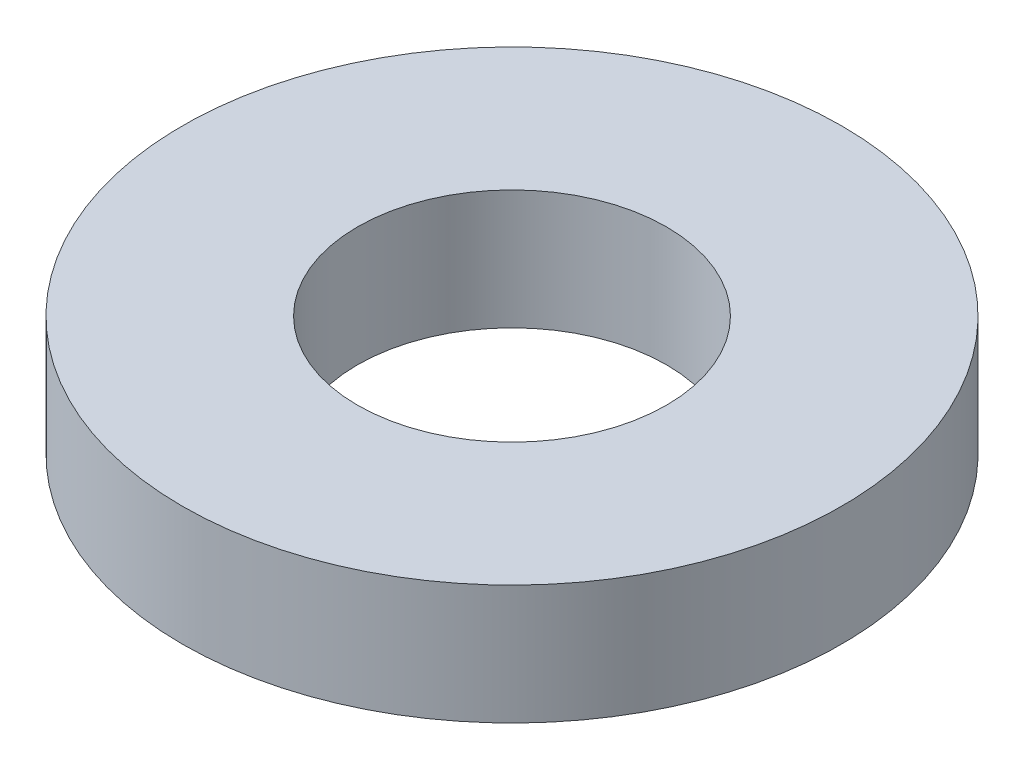
ISO-10303-21;
HEADER;
FILE_DESCRIPTION(('STEP AP214'),'2;1');
FILE_NAME('part.step','',(''),(''),'','','');
FILE_SCHEMA(('AUTOMOTIVE_DESIGN { 1 0 10303 214 1 1 1 1 }'));
ENDSEC;
DATA;
#1=APPLICATION_CONTEXT('core data for automotive mechanical design processes');
#2=APPLICATION_PROTOCOL_DEFINITION('international standard','automotive_design',2000,#1);
#3=PRODUCT_CONTEXT('',#1,'mechanical');
#4=PRODUCT('Part','Part','',(#3));
#5=PRODUCT_RELATED_PRODUCT_CATEGORY('part','',(#4));
#6=PRODUCT_DEFINITION_FORMATION('','',#4);
#7=PRODUCT_DEFINITION_CONTEXT('part definition',#1,'design');
#8=PRODUCT_DEFINITION('design','',#6,#7);
#9=PRODUCT_DEFINITION_SHAPE('','',#8);
#10=(LENGTH_UNIT() NAMED_UNIT(*) SI_UNIT(.MILLI.,.METRE.));
#11=(NAMED_UNIT(*) PLANE_ANGLE_UNIT() SI_UNIT($,.RADIAN.));
#12=(NAMED_UNIT(*) SI_UNIT($,.STERADIAN.) SOLID_ANGLE_UNIT());
#13=UNCERTAINTY_MEASURE_WITH_UNIT(LENGTH_MEASURE(1.E-05),#10,'distance_accuracy_value','');
#14=(GEOMETRIC_REPRESENTATION_CONTEXT(3) GLOBAL_UNCERTAINTY_ASSIGNED_CONTEXT((#13)) GLOBAL_UNIT_ASSIGNED_CONTEXT((#10,
#11,#12)) REPRESENTATION_CONTEXT('',''));
#15=CARTESIAN_POINT('',(0.,0.,0.));
#16=DIRECTION('',(0.,0.,1.));
#17=DIRECTION('',(1.,0.,0.));
#18=AXIS2_PLACEMENT_3D('',#15,#16,#17);
#19=CARTESIAN_POINT('',(0.,29.,0.));
#20=DIRECTION('',(0.,-1.,0.));
#21=DIRECTION('',(0.,0.,-1.));
#22=AXIS2_PLACEMENT_3D('',#19,#20,#21);
#23=CYLINDRICAL_SURFACE('',#22,80.);
#24=CARTESIAN_POINT('',(0.,29.,0.));
#25=DIRECTION('',(0.,1.,0.));
#26=DIRECTION('',(0.,0.,1.));
#27=AXIS2_PLACEMENT_3D('',#24,#25,#26);
#28=CIRCLE('',#27,80.);
#29=CARTESIAN_POINT('',(0.,29.,-80.));
#30=VERTEX_POINT('',#29);
#31=EDGE_CURVE('E10',#30,#30,#28,.T.);
#32=CARTESIAN_POINT('',(0.,0.,0.));
#33=DIRECTION('',(0.,1.,0.));
#34=DIRECTION('',(0.,0.,1.));
#35=AXIS2_PLACEMENT_3D('',#32,#33,#34);
#36=CIRCLE('',#35,80.);
#37=CARTESIAN_POINT('',(0.,0.,-80.));
#38=VERTEX_POINT('',#37);
#39=EDGE_CURVE('E37',#38,#38,#36,.T.);
#40=CARTESIAN_POINT('',(0.,29.,-80.));
#41=CARTESIAN_POINT('',(0.,28.6979166666667,-80.));
#42=CARTESIAN_POINT('',(0.,28.3958333333333,-80.));
#43=CARTESIAN_POINT('',(0.,27.7916666666667,-80.));
#44=CARTESIAN_POINT('',(0.,27.4895833333333,-80.));
#45=CARTESIAN_POINT('',(0.,26.8854166666667,-80.));
#46=CARTESIAN_POINT('',(0.,26.5833333333333,-80.));
#47=CARTESIAN_POINT('',(0.,25.9791666666667,-80.));
#48=CARTESIAN_POINT('',(0.,25.6770833333333,-80.));
#49=CARTESIAN_POINT('',(0.,25.0729166666667,-80.));
#50=CARTESIAN_POINT('',(0.,24.7708333333333,-80.));
#51=CARTESIAN_POINT('',(0.,24.1666666666667,-80.));
#52=CARTESIAN_POINT('',(0.,23.8645833333333,-80.));
#53=CARTESIAN_POINT('',(0.,23.2604166666667,-80.));
#54=CARTESIAN_POINT('',(0.,22.9583333333333,-80.));
#55=CARTESIAN_POINT('',(0.,22.3541666666667,-80.));
#56=CARTESIAN_POINT('',(0.,22.0520833333333,-80.));
#57=CARTESIAN_POINT('',(0.,21.4479166666667,-80.));
#58=CARTESIAN_POINT('',(0.,21.1458333333333,-80.));
#59=CARTESIAN_POINT('',(0.,20.5416666666667,-80.));
#60=CARTESIAN_POINT('',(0.,20.2395833333333,-80.));
#61=CARTESIAN_POINT('',(0.,19.6354166666667,-80.));
#62=CARTESIAN_POINT('',(0.,19.3333333333333,-80.));
#63=CARTESIAN_POINT('',(0.,18.7291666666667,-80.));
#64=CARTESIAN_POINT('',(0.,18.4270833333333,-80.));
#65=CARTESIAN_POINT('',(0.,17.8229166666667,-80.));
#66=CARTESIAN_POINT('',(0.,17.5208333333333,-80.));
#67=CARTESIAN_POINT('',(0.,16.9166666666667,-80.));
#68=CARTESIAN_POINT('',(0.,16.6145833333333,-80.));
#69=CARTESIAN_POINT('',(0.,16.0104166666667,-80.));
#70=CARTESIAN_POINT('',(0.,15.7083333333333,-80.));
#71=CARTESIAN_POINT('',(0.,15.1041666666667,-80.));
#72=CARTESIAN_POINT('',(0.,14.8020833333333,-80.));
#73=CARTESIAN_POINT('',(0.,14.1979166666667,-80.));
#74=CARTESIAN_POINT('',(0.,13.8958333333333,-80.));
#75=CARTESIAN_POINT('',(0.,13.2916666666667,-80.));
#76=CARTESIAN_POINT('',(0.,12.9895833333333,-80.));
#77=CARTESIAN_POINT('',(0.,12.3854166666667,-80.));
#78=CARTESIAN_POINT('',(0.,12.0833333333333,-80.));
#79=CARTESIAN_POINT('',(0.,11.4791666666667,-80.));
#80=CARTESIAN_POINT('',(0.,11.1770833333333,-80.));
#81=CARTESIAN_POINT('',(0.,10.5729166666667,-80.));
#82=CARTESIAN_POINT('',(0.,10.2708333333333,-80.));
#83=CARTESIAN_POINT('',(0.,9.66666666666667,-80.));
#84=CARTESIAN_POINT('',(0.,9.36458333333333,-80.));
#85=CARTESIAN_POINT('',(0.,8.76041666666667,-80.));
#86=CARTESIAN_POINT('',(0.,8.45833333333333,-80.));
#87=CARTESIAN_POINT('',(0.,7.85416666666667,-80.));
#88=CARTESIAN_POINT('',(0.,7.55208333333333,-80.));
#89=CARTESIAN_POINT('',(0.,6.94791666666667,-80.));
#90=CARTESIAN_POINT('',(0.,6.64583333333333,-80.));
#91=CARTESIAN_POINT('',(0.,6.04166666666667,-80.));
#92=CARTESIAN_POINT('',(0.,5.73958333333333,-80.));
#93=CARTESIAN_POINT('',(0.,5.13541666666667,-80.));
#94=CARTESIAN_POINT('',(0.,4.83333333333333,-80.));
#95=CARTESIAN_POINT('',(0.,4.22916666666667,-80.));
#96=CARTESIAN_POINT('',(0.,3.92708333333333,-80.));
#97=CARTESIAN_POINT('',(0.,3.32291666666667,-80.));
#98=CARTESIAN_POINT('',(0.,3.02083333333333,-80.));
#99=CARTESIAN_POINT('',(0.,2.41666666666667,-80.));
#100=CARTESIAN_POINT('',(0.,2.11458333333333,-80.));
#101=CARTESIAN_POINT('',(0.,1.51041666666667,-80.));
#102=CARTESIAN_POINT('',(0.,1.20833333333333,-80.));
#103=CARTESIAN_POINT('',(0.,0.604166666666667,-80.));
#104=CARTESIAN_POINT('',(0.,0.302083333333333,-80.));
#105=CARTESIAN_POINT('',(0.,0.,-80.));
#106=B_SPLINE_CURVE_WITH_KNOTS('',3,(#40,#41,#42,#43,#44,#45,#46,#47,#48,#49,#50,#51,#52,#53,
#54,#55,#56,#57,#58,#59,#60,#61,#62,#63,#64,#65,#66,#67,#68,#69,#70,#71,#72,#73,#74,#75,#76,#77,
#78,#79,#80,#81,#82,#83,#84,#85,#86,#87,#88,#89,#90,#91,#92,#93,#94,#95,#96,#97,#98,#99,#100,
#101,#102,#103,#104,#105),.UNSPECIFIED.,.F.,.F.,(4,2,2,2,2,2,2,2,2,2,2,2,2,2,2,2,2,2,2,2,2,2,2,
2,2,2,2,2,2,2,2,2,4),(0.,0.906249999999997,1.8125,2.71875,3.625,4.53125,5.4375,6.34375,7.25,
8.15625,9.0625,9.96875,10.875,11.78125,12.6875,13.59375,14.5,15.40625,16.3125,17.21875,18.125,
19.03125,19.9375,20.84375,21.75,22.65625,23.5625,24.46875,25.375,26.28125,27.1875,28.09375,29.),.UNSPECIFIED.);
#107=EDGE_CURVE('BSEAM40',#30,#38,#106,.T.);
#108=ORIENTED_EDGE('',*,*,#31,.F.);
#109=ORIENTED_EDGE('',*,*,#39,.T.);
#110=ORIENTED_EDGE('',*,*,#107,.T.);
#111=ORIENTED_EDGE('',*,*,#107,.F.);
#112=EDGE_LOOP('',(#108,#110,#109,#111));
#113=FACE_BOUND('',#112,.T.);
#114=ADVANCED_FACE('F40',(#113),#23,.T.);
#115=CARTESIAN_POINT('',(0.,29.,0.));
#116=DIRECTION('',(0.,1.,0.));
#117=DIRECTION('',(0.,0.,1.));
#118=AXIS2_PLACEMENT_3D('',#115,#116,#117);
#119=PLANE('',#118);
#120=CARTESIAN_POINT('',(0.,29.,0.));
#121=DIRECTION('',(0.,1.,0.));
#122=DIRECTION('',(0.,0.,1.));
#123=AXIS2_PLACEMENT_3D('',#120,#121,#122);
#124=CIRCLE('',#123,37.5);
#125=CARTESIAN_POINT('',(0.,29.,-37.5));
#126=VERTEX_POINT('',#125);
#127=EDGE_CURVE('E50',#126,#126,#124,.T.);
#128=ORIENTED_EDGE('',*,*,#127,.F.);
#129=EDGE_LOOP('',(#128));
#130=FACE_BOUND('',#129,.T.);
#131=ORIENTED_EDGE('',*,*,#31,.T.);
#132=EDGE_LOOP('',(#131));
#133=FACE_BOUND('',#132,.T.);
#134=ADVANCED_FACE('F59',(#130,#133),#119,.T.);
#135=CARTESIAN_POINT('',(0.,0.,0.));
#136=DIRECTION('',(0.,1.,0.));
#137=DIRECTION('',(0.,0.,1.));
#138=AXIS2_PLACEMENT_3D('',#135,#136,#137);
#139=PLANE('',#138);
#140=CARTESIAN_POINT('',(0.,0.,0.));
#141=DIRECTION('',(0.,1.,0.));
#142=DIRECTION('',(0.,0.,1.));
#143=AXIS2_PLACEMENT_3D('',#140,#141,#142);
#144=CIRCLE('',#143,37.5);
#145=CARTESIAN_POINT('',(0.,0.,-37.5));
#146=VERTEX_POINT('',#145);
#147=EDGE_CURVE('E47',#146,#146,#144,.T.);
#148=ORIENTED_EDGE('',*,*,#147,.T.);
#149=EDGE_LOOP('',(#148));
#150=FACE_BOUND('',#149,.T.);
#151=ORIENTED_EDGE('',*,*,#39,.F.);
#152=EDGE_LOOP('',(#151));
#153=FACE_BOUND('',#152,.T.);
#154=ADVANCED_FACE('F58',(#150,#153),#139,.F.);
#155=CARTESIAN_POINT('',(0.,29.,0.));
#156=DIRECTION('',(0.,-1.,0.));
#157=DIRECTION('',(0.,0.,-1.));
#158=AXIS2_PLACEMENT_3D('',#155,#156,#157);
#159=CYLINDRICAL_SURFACE('',#158,37.5);
#160=CARTESIAN_POINT('',(0.,29.,-37.5));
#161=CARTESIAN_POINT('',(0.,28.6979166666667,-37.5));
#162=CARTESIAN_POINT('',(0.,28.3958333333333,-37.5));
#163=CARTESIAN_POINT('',(0.,27.7916666666667,-37.5));
#164=CARTESIAN_POINT('',(0.,27.4895833333333,-37.5));
#165=CARTESIAN_POINT('',(0.,26.8854166666667,-37.5));
#166=CARTESIAN_POINT('',(0.,26.5833333333333,-37.5));
#167=CARTESIAN_POINT('',(0.,25.9791666666667,-37.5));
#168=CARTESIAN_POINT('',(0.,25.6770833333333,-37.5));
#169=CARTESIAN_POINT('',(0.,25.0729166666667,-37.5));
#170=CARTESIAN_POINT('',(0.,24.7708333333333,-37.5));
#171=CARTESIAN_POINT('',(0.,24.1666666666667,-37.5));
#172=CARTESIAN_POINT('',(0.,23.8645833333333,-37.5));
#173=CARTESIAN_POINT('',(0.,23.2604166666667,-37.5));
#174=CARTESIAN_POINT('',(0.,22.9583333333333,-37.5));
#175=CARTESIAN_POINT('',(0.,22.3541666666667,-37.5));
#176=CARTESIAN_POINT('',(0.,22.0520833333333,-37.5));
#177=CARTESIAN_POINT('',(0.,21.4479166666667,-37.5));
#178=CARTESIAN_POINT('',(0.,21.1458333333333,-37.5));
#179=CARTESIAN_POINT('',(0.,20.5416666666667,-37.5));
#180=CARTESIAN_POINT('',(0.,20.2395833333333,-37.5));
#181=CARTESIAN_POINT('',(0.,19.6354166666667,-37.5));
#182=CARTESIAN_POINT('',(0.,19.3333333333333,-37.5));
#183=CARTESIAN_POINT('',(0.,18.7291666666667,-37.5));
#184=CARTESIAN_POINT('',(0.,18.4270833333333,-37.5));
#185=CARTESIAN_POINT('',(0.,17.8229166666667,-37.5));
#186=CARTESIAN_POINT('',(0.,17.5208333333333,-37.5));
#187=CARTESIAN_POINT('',(0.,16.9166666666667,-37.5));
#188=CARTESIAN_POINT('',(0.,16.6145833333333,-37.5));
#189=CARTESIAN_POINT('',(0.,16.0104166666667,-37.5));
#190=CARTESIAN_POINT('',(0.,15.7083333333333,-37.5));
#191=CARTESIAN_POINT('',(0.,15.1041666666667,-37.5));
#192=CARTESIAN_POINT('',(0.,14.8020833333333,-37.5));
#193=CARTESIAN_POINT('',(0.,14.1979166666667,-37.5));
#194=CARTESIAN_POINT('',(0.,13.8958333333333,-37.5));
#195=CARTESIAN_POINT('',(0.,13.2916666666667,-37.5));
#196=CARTESIAN_POINT('',(0.,12.9895833333333,-37.5));
#197=CARTESIAN_POINT('',(0.,12.3854166666667,-37.5));
#198=CARTESIAN_POINT('',(0.,12.0833333333333,-37.5));
#199=CARTESIAN_POINT('',(0.,11.4791666666667,-37.5));
#200=CARTESIAN_POINT('',(0.,11.1770833333333,-37.5));
#201=CARTESIAN_POINT('',(0.,10.5729166666667,-37.5));
#202=CARTESIAN_POINT('',(0.,10.2708333333333,-37.5));
#203=CARTESIAN_POINT('',(0.,9.66666666666667,-37.5));
#204=CARTESIAN_POINT('',(0.,9.36458333333333,-37.5));
#205=CARTESIAN_POINT('',(0.,8.76041666666667,-37.5));
#206=CARTESIAN_POINT('',(0.,8.45833333333333,-37.5));
#207=CARTESIAN_POINT('',(0.,7.85416666666667,-37.5));
#208=CARTESIAN_POINT('',(0.,7.55208333333333,-37.5));
#209=CARTESIAN_POINT('',(0.,6.94791666666667,-37.5));
#210=CARTESIAN_POINT('',(0.,6.64583333333333,-37.5));
#211=CARTESIAN_POINT('',(0.,6.04166666666667,-37.5));
#212=CARTESIAN_POINT('',(0.,5.73958333333333,-37.5));
#213=CARTESIAN_POINT('',(0.,5.13541666666667,-37.5));
#214=CARTESIAN_POINT('',(0.,4.83333333333333,-37.5));
#215=CARTESIAN_POINT('',(0.,4.22916666666667,-37.5));
#216=CARTESIAN_POINT('',(0.,3.92708333333333,-37.5));
#217=CARTESIAN_POINT('',(0.,3.32291666666667,-37.5));
#218=CARTESIAN_POINT('',(0.,3.02083333333333,-37.5));
#219=CARTESIAN_POINT('',(0.,2.41666666666667,-37.5));
#220=CARTESIAN_POINT('',(0.,2.11458333333333,-37.5));
#221=CARTESIAN_POINT('',(0.,1.51041666666667,-37.5));
#222=CARTESIAN_POINT('',(0.,1.20833333333333,-37.5));
#223=CARTESIAN_POINT('',(0.,0.604166666666667,-37.5));
#224=CARTESIAN_POINT('',(0.,0.302083333333333,-37.5));
#225=CARTESIAN_POINT('',(0.,0.,-37.5));
#226=B_SPLINE_CURVE_WITH_KNOTS('',3,(#160,#161,#162,#163,#164,#165,#166,#167,#168,#169,#170,
#171,#172,#173,#174,#175,#176,#177,#178,#179,#180,#181,#182,#183,#184,#185,#186,#187,#188,#189,
#190,#191,#192,#193,#194,#195,#196,#197,#198,#199,#200,#201,#202,#203,#204,#205,#206,#207,#208,
#209,#210,#211,#212,#213,#214,#215,#216,#217,#218,#219,#220,#221,#222,#223,#224,#225),
.UNSPECIFIED.,.F.,.F.,(4,2,2,2,2,2,2,2,2,2,2,2,2,2,2,2,2,2,2,2,2,2,2,2,2,2,2,2,2,2,2,2,4),(0.,
0.906249999999997,1.8125,2.71875,3.625,4.53125,5.4375,6.34375,7.25,8.15625,9.0625,9.96875,
10.875,11.78125,12.6875,13.59375,14.5,15.40625,16.3125,17.21875,18.125,19.03125,19.9375,
20.84375,21.75,22.65625,23.5625,24.46875,25.375,26.28125,27.1875,28.09375,29.),.UNSPECIFIED.);
#227=EDGE_CURVE('BSEAM54',#126,#146,#226,.T.);
#228=ORIENTED_EDGE('',*,*,#127,.T.);
#229=ORIENTED_EDGE('',*,*,#147,.F.);
#230=ORIENTED_EDGE('',*,*,#227,.T.);
#231=ORIENTED_EDGE('',*,*,#227,.F.);
#232=EDGE_LOOP('',(#228,#230,#229,#231));
#233=FACE_BOUND('',#232,.T.);
#234=ADVANCED_FACE('F54',(#233),#159,.F.);
#235=CLOSED_SHELL('',(#114,#134,#154,#234));
#236=MANIFOLD_SOLID_BREP('B2',#235);
#237=ADVANCED_BREP_SHAPE_REPRESENTATION('',(#18,#236),#14);
#238=SHAPE_DEFINITION_REPRESENTATION(#9,#237);
ENDSEC;
END-ISO-10303-21;
